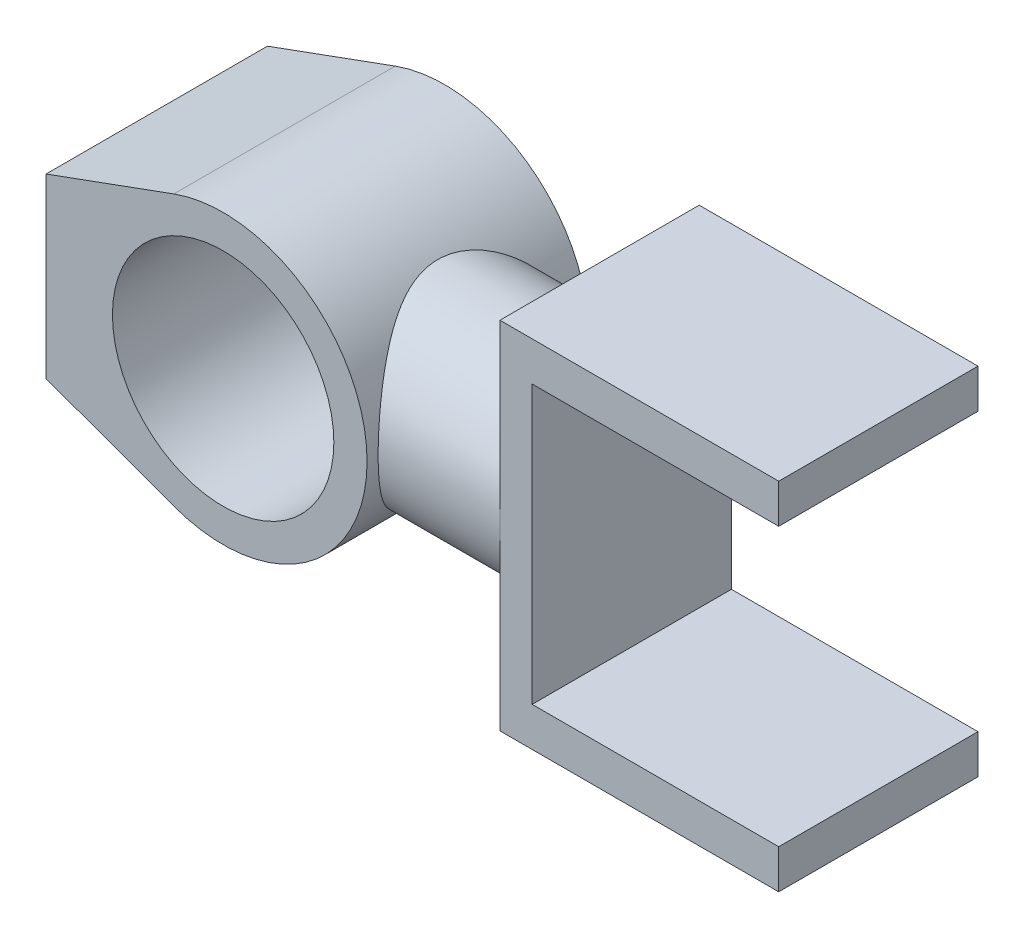
ISO-10303-21;
HEADER;
FILE_DESCRIPTION(('STEP AP214'),'2;1');
FILE_NAME('part.step','',(''),(''),'','','');
FILE_SCHEMA(('AUTOMOTIVE_DESIGN { 1 0 10303 214 1 1 1 1 }'));
ENDSEC;
DATA;
#1=APPLICATION_CONTEXT('core data for automotive mechanical design processes');
#2=APPLICATION_PROTOCOL_DEFINITION('international standard','automotive_design',2000,#1);
#3=PRODUCT_CONTEXT('',#1,'mechanical');
#4=PRODUCT('Part','Part','',(#3));
#5=PRODUCT_RELATED_PRODUCT_CATEGORY('part','',(#4));
#6=PRODUCT_DEFINITION_FORMATION('','',#4);
#7=PRODUCT_DEFINITION_CONTEXT('part definition',#1,'design');
#8=PRODUCT_DEFINITION('design','',#6,#7);
#9=PRODUCT_DEFINITION_SHAPE('','',#8);
#10=(LENGTH_UNIT() NAMED_UNIT(*) SI_UNIT(.MILLI.,.METRE.));
#11=(NAMED_UNIT(*) PLANE_ANGLE_UNIT() SI_UNIT($,.RADIAN.));
#12=(NAMED_UNIT(*) SI_UNIT($,.STERADIAN.) SOLID_ANGLE_UNIT());
#13=UNCERTAINTY_MEASURE_WITH_UNIT(LENGTH_MEASURE(1.E-05),#10,'distance_accuracy_value','');
#14=(GEOMETRIC_REPRESENTATION_CONTEXT(3) GLOBAL_UNCERTAINTY_ASSIGNED_CONTEXT((#13)) GLOBAL_UNIT_ASSIGNED_CONTEXT((#10,
#11,#12)) REPRESENTATION_CONTEXT('',''));
#15=CARTESIAN_POINT('',(0.,0.,0.));
#16=DIRECTION('',(0.,0.,1.));
#17=DIRECTION('',(1.,0.,0.));
#18=AXIS2_PLACEMENT_3D('',#15,#16,#17);
#19=CARTESIAN_POINT('',(0.,0.,50.));
#20=DIRECTION('',(0.,0.,1.));
#21=DIRECTION('',(1.,0.,0.));
#22=AXIS2_PLACEMENT_3D('',#19,#20,#21);
#23=PLANE('',#22);
#24=DIRECTION('',(0.939410286372225,-0.342794856813887,0.));
#25=VECTOR('',#24,1.);
#26=CARTESIAN_POINT('',(-80.,-40.,50.));
#27=LINE('',#26,#25);
#28=CARTESIAN_POINT('',(-80.,-40.,50.));
#29=VERTEX_POINT('',#28);
#30=CARTESIAN_POINT('',(-22.2816656929027,-61.0616686141946,50.));
#31=VERTEX_POINT('',#30);
#32=EDGE_CURVE('E309',#29,#31,#27,.T.);
#33=ORIENTED_EDGE('',*,*,#32,.T.);
#34=CARTESIAN_POINT('',(0.,0.,50.));
#35=DIRECTION('',(0.,0.,1.));
#36=DIRECTION('',(1.,0.,0.));
#37=AXIS2_PLACEMENT_3D('',#34,#35,#36);
#38=CIRCLE('',#37,65.);
#39=CARTESIAN_POINT('',(-22.2816656929027,61.0616686141947,50.));
#40=VERTEX_POINT('',#39);
#41=EDGE_CURVE('E90',#31,#40,#38,.T.);
#42=ORIENTED_EDGE('',*,*,#41,.T.);
#43=DIRECTION('',(-0.939410286372225,-0.342794856813887,0.));
#44=VECTOR('',#43,1.);
#45=CARTESIAN_POINT('',(-80.,40.,50.));
#46=LINE('',#45,#44);
#47=CARTESIAN_POINT('',(-80.,40.,50.));
#48=VERTEX_POINT('',#47);
#49=EDGE_CURVE('E305',#40,#48,#46,.T.);
#50=ORIENTED_EDGE('',*,*,#49,.T.);
#51=DIRECTION('',(0.,-1.,0.));
#52=VECTOR('',#51,1.);
#53=CARTESIAN_POINT('',(-80.,40.,50.));
#54=LINE('',#53,#52);
#55=EDGE_CURVE('E62',#48,#29,#54,.T.);
#56=ORIENTED_EDGE('',*,*,#55,.T.);
#57=EDGE_LOOP('',(#33,#42,#50,#56));
#58=FACE_BOUND('',#57,.T.);
#59=CARTESIAN_POINT('',(0.,0.,50.));
#60=DIRECTION('',(0.,0.,1.));
#61=DIRECTION('',(1.,0.,0.));
#62=AXIS2_PLACEMENT_3D('',#59,#60,#61);
#63=CIRCLE('',#62,50.);
#64=CARTESIAN_POINT('',(50.,0.,50.));
#65=VERTEX_POINT('',#64);
#66=EDGE_CURVE('E319',#65,#65,#63,.T.);
#67=ORIENTED_EDGE('',*,*,#66,.F.);
#68=EDGE_LOOP('',(#67));
#69=FACE_BOUND('',#68,.T.);
#70=ADVANCED_FACE('F39',(#58,#69),#23,.T.);
#71=CARTESIAN_POINT('',(0.,0.,-50.));
#72=DIRECTION('',(0.,0.,1.));
#73=DIRECTION('',(1.,0.,0.));
#74=AXIS2_PLACEMENT_3D('',#71,#72,#73);
#75=PLANE('',#74);
#76=DIRECTION('',(0.939410286372225,-0.342794856813887,0.));
#77=VECTOR('',#76,1.);
#78=CARTESIAN_POINT('',(-80.,-40.,-50.));
#79=LINE('',#78,#77);
#80=CARTESIAN_POINT('',(-80.,-40.,-50.));
#81=VERTEX_POINT('',#80);
#82=CARTESIAN_POINT('',(-22.2816656929027,-61.0616686141946,-50.));
#83=VERTEX_POINT('',#82);
#84=EDGE_CURVE('E302',#81,#83,#79,.T.);
#85=ORIENTED_EDGE('',*,*,#84,.F.);
#86=DIRECTION('',(0.,-1.,0.));
#87=VECTOR('',#86,1.);
#88=CARTESIAN_POINT('',(-80.,40.,-50.));
#89=LINE('',#88,#87);
#90=CARTESIAN_POINT('',(-80.,40.,-50.));
#91=VERTEX_POINT('',#90);
#92=EDGE_CURVE('E83',#91,#81,#89,.T.);
#93=ORIENTED_EDGE('',*,*,#92,.F.);
#94=DIRECTION('',(-0.939410286372225,-0.342794856813887,0.));
#95=VECTOR('',#94,1.);
#96=CARTESIAN_POINT('',(-80.,40.,-50.));
#97=LINE('',#96,#95);
#98=CARTESIAN_POINT('',(-22.2816656929027,61.0616686141947,-50.));
#99=VERTEX_POINT('',#98);
#100=EDGE_CURVE('E301',#99,#91,#97,.T.);
#101=ORIENTED_EDGE('',*,*,#100,.F.);
#102=CARTESIAN_POINT('',(0.,0.,-50.));
#103=DIRECTION('',(0.,0.,1.));
#104=DIRECTION('',(1.,0.,0.));
#105=AXIS2_PLACEMENT_3D('',#102,#103,#104);
#106=CIRCLE('',#105,65.);
#107=EDGE_CURVE('E294',#83,#99,#106,.T.);
#108=ORIENTED_EDGE('',*,*,#107,.F.);
#109=EDGE_LOOP('',(#85,#93,#101,#108));
#110=FACE_BOUND('',#109,.T.);
#111=CARTESIAN_POINT('',(0.,0.,-50.));
#112=DIRECTION('',(0.,0.,1.));
#113=DIRECTION('',(1.,0.,0.));
#114=AXIS2_PLACEMENT_3D('',#111,#112,#113);
#115=CIRCLE('',#114,50.);
#116=CARTESIAN_POINT('',(50.,0.,-50.));
#117=VERTEX_POINT('',#116);
#118=EDGE_CURVE('E321',#117,#117,#115,.T.);
#119=ORIENTED_EDGE('',*,*,#118,.T.);
#120=EDGE_LOOP('',(#119));
#121=FACE_BOUND('',#120,.T.);
#122=ADVANCED_FACE('F270',(#110,#121),#75,.F.);
#123=CARTESIAN_POINT('',(-80.,-40.,50.));
#124=DIRECTION('',(0.342794856813887,0.939410286372225,0.));
#125=DIRECTION('',(-0.939410286372225,0.342794856813887,0.));
#126=AXIS2_PLACEMENT_3D('',#123,#124,#125);
#127=PLANE('',#126);
#128=ORIENTED_EDGE('',*,*,#84,.T.);
#129=DIRECTION('',(0.,0.,-1.));
#130=VECTOR('',#129,1.);
#131=CARTESIAN_POINT('',(-22.2816656929027,-61.0616686141946,50.));
#132=LINE('',#131,#130);
#133=EDGE_CURVE('E11',#31,#83,#132,.T.);
#134=ORIENTED_EDGE('',*,*,#133,.F.);
#135=ORIENTED_EDGE('',*,*,#32,.F.);
#136=DIRECTION('',(0.,0.,-1.));
#137=VECTOR('',#136,1.);
#138=CARTESIAN_POINT('',(-80.,-40.,50.));
#139=LINE('',#138,#137);
#140=EDGE_CURVE('E313',#29,#81,#139,.T.);
#141=ORIENTED_EDGE('',*,*,#140,.T.);
#142=EDGE_LOOP('',(#128,#134,#135,#141));
#143=FACE_BOUND('',#142,.T.);
#144=ADVANCED_FACE('F41',(#143),#127,.F.);
#145=CARTESIAN_POINT('',(0.,0.,50.));
#146=DIRECTION('',(0.,0.,-1.));
#147=DIRECTION('',(-1.,0.,0.));
#148=AXIS2_PLACEMENT_3D('',#145,#146,#147);
#149=CYLINDRICAL_SURFACE('',#148,65.);
#150=CARTESIAN_POINT('',(65.,0.,-45.));
#151=CARTESIAN_POINT('',(65.0000011696057,1.12147330120565,-45.0000012025283));
#152=CARTESIAN_POINT('',(64.9709159765212,2.24292945230778,-44.9580201602482));
#153=CARTESIAN_POINT('',(64.8553068641383,4.47658414079082,-44.790785609369));
#154=CARTESIAN_POINT('',(64.7687842573088,5.58878288911931,-44.6655340035371));
#155=CARTESIAN_POINT('',(64.5403785763001,7.79555151848628,-44.3336771879691));
#156=CARTESIAN_POINT('',(64.3984760503456,8.89011506447751,-44.1270433931238));
#157=CARTESIAN_POINT('',(64.0626457436966,11.0533096019768,-43.6354760134034));
#158=CARTESIAN_POINT('',(63.8687169569864,12.1219400915896,-43.3505409144375));
#159=CARTESIAN_POINT('',(63.4342222744662,14.2212125160505,-42.7078017297046));
#160=CARTESIAN_POINT('',(63.1938918545645,15.2520162370063,-42.3503651251477));
#161=CARTESIAN_POINT('',(62.6709259446924,17.2756280115286,-41.5659763086892));
#162=CARTESIAN_POINT('',(62.3882907364915,18.268436318107,-41.1390245597888));
#163=CARTESIAN_POINT('',(61.786108553932,20.2116697228795,-40.2199419970838));
#164=CARTESIAN_POINT('',(61.4665619062631,21.1620951960855,-39.7278117601444));
#165=CARTESIAN_POINT('',(60.7962171584065,23.0172309124314,-38.6825647509799));
#166=CARTESIAN_POINT('',(60.4454175300334,23.9219389167185,-38.1294449962195));
#167=CARTESIAN_POINT('',(59.6865648974474,25.7601880140228,-36.9151737617935));
#168=CARTESIAN_POINT('',(59.27618815402,26.6893215363404,-36.2488040005491));
#169=CARTESIAN_POINT('',(58.4330275057249,28.4880338622967,-34.8529502059224));
#170=CARTESIAN_POINT('',(58.0002425478181,29.3576098626539,-34.1234632053608));
#171=CARTESIAN_POINT('',(57.1195111836477,31.0364486388513,-32.6040251352403));
#172=CARTESIAN_POINT('',(56.6715447181891,31.8456267033451,-31.8139921794123));
#173=CARTESIAN_POINT('',(55.7691986061138,33.4006700551814,-30.1773036556993));
#174=CARTESIAN_POINT('',(55.3148185876119,34.1465316534289,-29.3306447936721));
#175=CARTESIAN_POINT('',(54.3303114345595,35.6959084068904,-27.4326466159468));
#176=CARTESIAN_POINT('',(53.8005937511269,36.4872853280241,-26.3711450656527));
#177=CARTESIAN_POINT('',(52.7593327891933,37.9773509509911,-24.17604025639));
#178=CARTESIAN_POINT('',(52.2477941160227,38.6760162868262,-23.0424189272517));
#179=CARTESIAN_POINT('',(51.2608149265043,39.9749077721744,-20.7072341856928));
#180=CARTESIAN_POINT('',(50.7853275075273,40.5752630453964,-19.5057627267967));
#181=CARTESIAN_POINT('',(49.8892399163793,41.6721166930025,-17.036931864064));
#182=CARTESIAN_POINT('',(49.4686114171658,42.1686687478853,-15.7696069409943));
#183=CARTESIAN_POINT('',(48.8208029416879,42.9149535309565,-13.5723996352816));
#184=CARTESIAN_POINT('',(48.5738420263557,43.1936925213245,-12.6581208440976));
#185=CARTESIAN_POINT('',(48.1238801744123,43.6944569649788,-10.8035389223551));
#186=CARTESIAN_POINT('',(47.9208721021929,43.9164916250901,-9.86324004407419));
#187=CARTESIAN_POINT('',(47.5660754926548,44.3005296261305,-7.96250438663409));
#188=CARTESIAN_POINT('',(47.4142038087044,44.4626304606427,-7.00210302149487));
#189=CARTESIAN_POINT('',(47.1671263845177,44.7246555122386,-5.06554052628518));
#190=CARTESIAN_POINT('',(47.0719206259529,44.824579749433,-4.08937940131224));
#191=CARTESIAN_POINT('',(46.9418899090943,44.9607388198673,-2.1232364847967));
#192=CARTESIAN_POINT('',(46.9073939345417,44.9966266570423,-1.13320851844658));
#193=CARTESIAN_POINT('',(46.9013571135476,45.0029190462422,0.847248377093852));
#194=CARTESIAN_POINT('',(46.9298161498631,44.9733237202183,1.837677305534));
#195=CARTESIAN_POINT('',(47.0484302849821,44.8492190899201,3.81128752429081));
#196=CARTESIAN_POINT('',(47.13862305521,44.7546701492421,4.79446401850661));
#197=CARTESIAN_POINT('',(47.3768313176079,44.5024241630868,6.74551496467455));
#198=CARTESIAN_POINT('',(47.5248480621437,44.3447257499009,7.71338908473168));
#199=CARTESIAN_POINT('',(47.8621764271841,43.9803320764262,9.56919366964684));
#200=CARTESIAN_POINT('',(48.0484149088864,43.7772163066585,10.4583970625519));
#201=CARTESIAN_POINT('',(48.4609441046406,43.32010640119,12.2144143492181));
#202=CARTESIAN_POINT('',(48.6872496045115,43.0660934784815,13.0812198417583));
#203=CARTESIAN_POINT('',(49.1738509640383,42.5096331932465,14.7898225666927));
#204=CARTESIAN_POINT('',(49.4341648638834,42.2071601049958,15.6316062329481));
#205=CARTESIAN_POINT('',(49.9825182796335,41.5563350032134,17.2876417419013));
#206=CARTESIAN_POINT('',(50.2705534011697,41.2079902580444,18.1018979206949));
#207=CARTESIAN_POINT('',(51.0225431471345,40.2767822129268,20.1137766396802));
#208=CARTESIAN_POINT('',(51.5007434523328,39.6654891440572,21.2930273345177));
#209=CARTESIAN_POINT('',(52.4891158781477,38.348029920852,23.5833678403921));
#210=CARTESIAN_POINT('',(52.9993005340589,37.6418264436726,24.6944305853524));
#211=CARTESIAN_POINT('',(54.0361557973494,36.1376496350166,26.8476775780095));
#212=CARTESIAN_POINT('',(54.5628535785461,35.3395185623559,27.8897384505711));
#213=CARTESIAN_POINT('',(55.6171804467178,33.6558443419671,29.8998791095632));
#214=CARTESIAN_POINT('',(56.1448094104418,32.7703120184234,30.8679680307498));
#215=CARTESIAN_POINT('',(57.1932449701135,30.9045304086319,32.7363921475659));
#216=CARTESIAN_POINT('',(57.7139191350983,29.9233731295192,33.6358963165067));
#217=CARTESIAN_POINT('',(58.7296419536465,27.8771206485979,35.350355349792));
#218=CARTESIAN_POINT('',(59.2246882700661,26.8120178135979,36.1653025097018));
#219=CARTESIAN_POINT('',(60.1756566955639,24.6035209522421,37.7024332048813));
#220=CARTESIAN_POINT('',(60.6316475651595,23.4602711709794,38.4247809320632));
#221=CARTESIAN_POINT('',(61.4931891608211,21.0989507187335,39.7703323765769));
#222=CARTESIAN_POINT('',(61.898755017873,19.8809026570889,40.3935658507715));
#223=CARTESIAN_POINT('',(62.5646802947783,17.6549035875762,41.4059204565395));
#224=CARTESIAN_POINT('',(62.8372982548467,16.6602403417733,41.8163120535009));
#225=CARTESIAN_POINT('',(63.3397164077328,14.6345031625144,42.5675669112335));
#226=CARTESIAN_POINT('',(63.569522535998,13.603434299959,42.9084398107234));
#227=CARTESIAN_POINT('',(63.9815049902596,11.5110112910016,43.5164676119118));
#228=CARTESIAN_POINT('',(64.1637052650743,10.4496726714621,43.7836595836378));
#229=CARTESIAN_POINT('',(64.476639865795,8.30296993183371,44.2409869387356));
#230=CARTESIAN_POINT('',(64.6073730982257,7.21760530180254,44.431120684921));
#231=CARTESIAN_POINT('',(64.8147345736682,5.02649787175023,44.7321113931983));
#232=CARTESIAN_POINT('',(64.8911534961694,3.92069290489763,44.8426616714377));
#233=CARTESIAN_POINT('',(64.9872183357685,1.70145350776208,44.981563734156));
#234=CARTESIAN_POINT('',(65.0068642771874,0.588019080747696,45.0099155538474));
#235=CARTESIAN_POINT('',(64.9889001241945,-1.63741781931566,44.9839662509349));
#236=CARTESIAN_POINT('',(64.9512898349751,-2.74942028747967,44.929664847113));
#237=CARTESIAN_POINT('',(64.819734418053,-4.96298947367603,44.7392747901952));
#238=CARTESIAN_POINT('',(64.7257910494465,-6.06455651648127,44.6031886909653));
#239=CARTESIAN_POINT('',(64.491175703309,-8.18254449212149,44.2620157992034));
#240=CARTESIAN_POINT('',(64.3536808680178,-9.20007959997774,44.0616107864454));
#241=CARTESIAN_POINT('',(64.0337856060908,-11.2121337136589,43.5930613516679));
#242=CARTESIAN_POINT('',(63.8513873855499,-12.2066538475799,43.3249202574929));
#243=CARTESIAN_POINT('',(63.4451725249075,-14.1673074608523,42.7239854011605));
#244=CARTESIAN_POINT('',(63.2213525684632,-15.1334386601223,42.3911864622047));
#245=CARTESIAN_POINT('',(62.736336352677,-17.0327019487273,41.6643868113868));
#246=CARTESIAN_POINT('',(62.4751380044848,-17.965832190203,41.2703826790343));
#247=CARTESIAN_POINT('',(61.8990085085122,-19.8637431772395,40.3931275129008));
#248=CARTESIAN_POINT('',(61.5815209528501,-20.8256806929253,39.9054081529014));
#249=CARTESIAN_POINT('',(60.9142086391395,-22.7035764997345,38.8677076181211));
#250=CARTESIAN_POINT('',(60.5643826081083,-23.6195329786528,38.3177239921568));
#251=CARTESIAN_POINT('',(59.8381347129401,-25.4032558353403,37.1592008079418));
#252=CARTESIAN_POINT('',(59.4616987975441,-26.270996314329,36.5506302507532));
#253=CARTESIAN_POINT('',(58.6884577670336,-27.9557544991496,35.2787474176625));
#254=CARTESIAN_POINT('',(58.2916515549571,-28.7727694681138,34.6154321925309));
#255=CARTESIAN_POINT('',(57.4151711853793,-30.4889708749912,33.1199200847161));
#256=CARTESIAN_POINT('',(56.9328754552547,-31.3785212006928,32.2781812569548));
#257=CARTESIAN_POINT('',(55.9590893109094,-33.0839042215169,30.5278352445589));
#258=CARTESIAN_POINT('',(55.4675975421249,-33.8997259516808,29.6192181500899));
#259=CARTESIAN_POINT('',(54.4860350387397,-35.45586994741,27.7375714933993));
#260=CARTESIAN_POINT('',(53.9959654596117,-36.1961418986443,26.7644997080007));
#261=CARTESIAN_POINT('',(53.0294834997435,-37.5978502361011,24.7568233036382));
#262=CARTESIAN_POINT('',(52.553069328415,-38.2592969946585,23.7222268074148));
#263=CARTESIAN_POINT('',(51.679941347726,-39.4291013564639,21.7149007388747));
#264=CARTESIAN_POINT('',(51.2803372484816,-39.9463152685162,20.7485884228094));
#265=CARTESIAN_POINT('',(50.5123974548912,-40.9130636661729,18.7705314851885));
#266=CARTESIAN_POINT('',(50.1440619804653,-41.3625976757848,17.7587865441704));
#267=CARTESIAN_POINT('',(49.4504928922364,-42.1893301292689,15.693797265063));
#268=CARTESIAN_POINT('',(49.1251906412473,-42.566644202947,14.6406225749502));
#269=CARTESIAN_POINT('',(48.5290098021012,-43.2451098617227,12.4950157035289));
#270=CARTESIAN_POINT('',(48.2581179989952,-43.5462799449171,11.4025931307277));
#271=CARTESIAN_POINT('',(47.8271610412375,-44.0186874861181,9.3921629994351));
#272=CARTESIAN_POINT('',(47.6558419905218,-44.2036946073207,8.47979353570419));
#273=CARTESIAN_POINT('',(47.3627606953031,-44.517583244497,6.63757582668245));
#274=CARTESIAN_POINT('',(47.2409923142224,-44.6464717105955,5.70772976070373));
#275=CARTESIAN_POINT('',(47.05166615705,-44.8459556683364,3.83718735816971));
#276=CARTESIAN_POINT('',(46.9840561376509,-44.9166073394187,2.89650236820514));
#277=CARTESIAN_POINT('',(46.9055698265682,-44.9985645522097,1.01014116515035));
#278=CARTESIAN_POINT('',(46.894694331428,-45.0098692606967,0.0644648821697862));
#279=CARTESIAN_POINT('',(46.9301408777119,-44.972908524549,-1.82506201386804));
#280=CARTESIAN_POINT('',(46.9764888551696,-44.9246160680299,-2.76891160474201));
#281=CARTESIAN_POINT('',(47.1245232303033,-44.7693052695385,-4.64731891289862));
#282=CARTESIAN_POINT('',(47.226209296244,-44.6622872796082,-5.58187668584874));
#283=CARTESIAN_POINT('',(47.4811423262629,-44.3911660407895,-7.43666598606561));
#284=CARTESIAN_POINT('',(47.634452919394,-44.2269923369625,-8.35687836049678));
#285=CARTESIAN_POINT('',(47.9871889035597,-43.8440109221367,-10.1768310643423));
#286=CARTESIAN_POINT('',(48.1866204648689,-43.6251959006593,-11.0765686368372));
#287=CARTESIAN_POINT('',(48.6908782922366,-43.0625185245671,-13.116726178063));
#288=CARTESIAN_POINT('',(49.0093972350599,-42.7008255731353,-14.2488681052183));
#289=CARTESIAN_POINT('',(49.699554494161,-41.8955268796886,-16.4668795226373));
#290=CARTESIAN_POINT('',(50.0712093704162,-41.4518955887103,-17.5527344499461));
#291=CARTESIAN_POINT('',(50.8544123719762,-40.4872212981013,-19.6760329984318));
#292=CARTESIAN_POINT('',(51.2660067549033,-39.9660881554129,-20.7134183727638));
#293=CARTESIAN_POINT('',(52.116211879306,-38.8508952329155,-22.7363587217865));
#294=CARTESIAN_POINT('',(52.5548209260535,-38.2568400254561,-23.7219169406072));
#295=CARTESIAN_POINT('',(53.4579357785502,-36.9847423381263,-25.6613286822633));
#296=CARTESIAN_POINT('',(53.9228021101371,-36.3051118639051,-26.6139712103077));
#297=CARTESIAN_POINT('',(54.8583333343946,-34.8753950985048,-28.4617532840731));
#298=CARTESIAN_POINT('',(55.3289982185488,-34.1253089107936,-29.3568929142368));
#299=CARTESIAN_POINT('',(56.2664339133503,-32.5564691651912,-31.0876310121466));
#300=CARTESIAN_POINT('',(56.7332035093429,-31.7376950080829,-31.923211478402));
#301=CARTESIAN_POINT('',(57.6535165855435,-30.033481652025,-33.5315189390535));
#302=CARTESIAN_POINT('',(58.1070588196762,-29.1480362003111,-34.3042400240121));
#303=CARTESIAN_POINT('',(59.0635284336244,-27.1643113596245,-35.9022819462667));
#304=CARTESIAN_POINT('',(59.5626106290919,-26.0547472869609,-36.7159606163356));
#305=CARTESIAN_POINT('',(60.5176757229357,-23.7521280348398,-38.2458641369291));
#306=CARTESIAN_POINT('',(60.9736519283074,-22.5590599397198,-38.962073861155));
#307=CARTESIAN_POINT('',(61.6149926579414,-20.7127348127311,-39.9558623322098));
#308=CARTESIAN_POINT('',(61.8215919655179,-20.088110583999,-40.2735888165198));
#309=CARTESIAN_POINT('',(62.2191547005856,-18.8206694867556,-40.8812436548858));
#310=CARTESIAN_POINT('',(62.4101203779565,-18.1778552539997,-41.1711760099034));
#311=CARTESIAN_POINT('',(62.7748527233683,-16.875283117665,-41.7219931318356));
#312=CARTESIAN_POINT('',(62.9486230408552,-16.2155288469421,-41.9828840638124));
#313=CARTESIAN_POINT('',(63.2775356475737,-14.8804011558233,-42.4744610119283));
#314=CARTESIAN_POINT('',(63.432679284421,-14.2050288695917,-42.7051492133046));
#315=CARTESIAN_POINT('',(63.8070721968101,-12.4447010544915,-43.25974494481));
#316=CARTESIAN_POINT('',(64.0114184468014,-11.3490405228654,-43.5602757498286));
#317=CARTESIAN_POINT('',(64.3654191982087,-9.12991345978806,-44.078827644396));
#318=CARTESIAN_POINT('',(64.5150820049425,-8.00645117856259,-44.2968612637911));
#319=CARTESIAN_POINT('',(64.7559993187061,-5.74082253729113,-44.6470112993716));
#320=CARTESIAN_POINT('',(64.847297757104,-4.59867091062173,-44.7791923387443));
#321=CARTESIAN_POINT('',(64.9692976296881,-2.30434018473195,-44.9556862638234));
#322=CARTESIAN_POINT('',(64.9999987983895,-1.15216104160189,-44.999998764566));
#323=CARTESIAN_POINT('',(65.,0.,-45.));
#324=B_SPLINE_CURVE_WITH_KNOTS('',3,(#150,#151,#152,#153,#154,#155,#156,#157,#158,#159,#160,
#161,#162,#163,#164,#165,#166,#167,#168,#169,#170,#171,#172,#173,#174,#175,#176,#177,#178,#179,
#180,#181,#182,#183,#184,#185,#186,#187,#188,#189,#190,#191,#192,#193,#194,#195,#196,#197,#198,
#199,#200,#201,#202,#203,#204,#205,#206,#207,#208,#209,#210,#211,#212,#213,#214,#215,#216,#217,
#218,#219,#220,#221,#222,#223,#224,#225,#226,#227,#228,#229,#230,#231,#232,#233,#234,#235,#236,
#237,#238,#239,#240,#241,#242,#243,#244,#245,#246,#247,#248,#249,#250,#251,#252,#253,#254,#255,
#256,#257,#258,#259,#260,#261,#262,#263,#264,#265,#266,#267,#268,#269,#270,#271,#272,#273,#274,
#275,#276,#277,#278,#279,#280,#281,#282,#283,#284,#285,#286,#287,#288,#289,#290,#291,#292,#293,
#294,#295,#296,#297,#298,#299,#300,#301,#302,#303,#304,#305,#306,#307,#308,#309,#310,#311,#312,
#313,#314,#315,#316,#317,#318,#319,#320,#321,#322,#323),.UNSPECIFIED.,.T.,.F.,(4,2,2,2,2,2,2,2,
2,2,2,2,2,2,2,2,2,2,2,2,2,2,2,2,2,2,2,2,2,2,2,2,2,2,2,2,2,2,2,2,2,2,2,2,2,2,2,2,2,2,2,2,2,2,2,2,
2,2,2,2,2,2,2,2,2,2,2,2,2,2,2,2,2,2,2,2,2,2,2,2,2,2,2,2,2,2,4),(0.,3.36323892794144,
6.72640100710137,10.0907454360665,13.4551549250109,16.8029195613731,20.1506619010729,
23.4983746134034,26.8462511096753,30.4871649037346,34.1282499524345,37.7743494260164,
41.4206611917409,45.6939383064405,49.9682903731881,54.2369825353392,58.5034617073671,
61.4625138492405,64.4210852373372,67.3748225577202,70.3285589227263,73.2982527376573,
76.2679410220407,79.2394430998938,82.2110095388412,85.0011411726389,87.7923045951578,
90.584954683776,93.3771628083065,97.6064034875675,101.837312178738,106.075592113262,
110.313347816192,114.596218662803,118.879479402292,123.155037051935,127.429308626693,
130.755998382163,134.082226580387,137.406778235214,140.731400520075,144.068767009318,
147.406132068879,150.743508483461,154.080780688207,157.215791533369,160.350648386749,
163.485756334407,166.621039552604,169.990545063149,173.360183268584,176.73161428665,
180.103227050672,184.047902440152,187.993163521895,191.94103513809,195.888386692538,
199.385185586645,202.88200907258,206.373186157811,209.863514294626,212.700365177753,
215.536864625513,218.370624567028,221.204424293963,224.039508887241,226.874576485218,
229.713151272815,232.55210603787,236.23803941247,239.925124033801,243.616531168718,
247.307706963636,251.081871120678,254.856029735252,258.631324277359,262.406973327354,
266.792058434818,271.177823293658,273.368885604935,275.55963203795,277.749912517597,
279.940034437727,283.398420446896,286.856280978073,290.31153567335,293.766805506531),.UNSPECIFIED.);
#325=CARTESIAN_POINT('',(65.,0.,-45.));
#326=VERTEX_POINT('',#325);
#327=EDGE_CURVE('E161',#326,#326,#324,.T.);
#328=ORIENTED_EDGE('',*,*,#327,.F.);
#329=EDGE_LOOP('',(#328));
#330=FACE_BOUND('',#329,.T.);
#331=ORIENTED_EDGE('',*,*,#107,.T.);
#332=DIRECTION('',(0.,0.,-1.));
#333=VECTOR('',#332,1.);
#334=CARTESIAN_POINT('',(-22.2816656929027,61.0616686141947,50.));
#335=LINE('',#334,#333);
#336=EDGE_CURVE('E47',#40,#99,#335,.T.);
#337=ORIENTED_EDGE('',*,*,#336,.F.);
#338=ORIENTED_EDGE('',*,*,#41,.F.);
#339=ORIENTED_EDGE('',*,*,#133,.T.);
#340=EDGE_LOOP('',(#331,#337,#338,#339));
#341=FACE_BOUND('',#340,.T.);
#342=ADVANCED_FACE('F285',(#330,#341),#149,.T.);
#343=CARTESIAN_POINT('',(-80.,40.,50.));
#344=DIRECTION('',(0.342794856813887,-0.939410286372225,0.));
#345=DIRECTION('',(0.939410286372225,0.342794856813887,0.));
#346=AXIS2_PLACEMENT_3D('',#343,#344,#345);
#347=PLANE('',#346);
#348=ORIENTED_EDGE('',*,*,#100,.T.);
#349=DIRECTION('',(0.,0.,-1.));
#350=VECTOR('',#349,1.);
#351=CARTESIAN_POINT('',(-80.,40.,50.));
#352=LINE('',#351,#350);
#353=EDGE_CURVE('E306',#48,#91,#352,.T.);
#354=ORIENTED_EDGE('',*,*,#353,.F.);
#355=ORIENTED_EDGE('',*,*,#49,.F.);
#356=ORIENTED_EDGE('',*,*,#336,.T.);
#357=EDGE_LOOP('',(#348,#354,#355,#356));
#358=FACE_BOUND('',#357,.T.);
#359=ADVANCED_FACE('F283',(#358),#347,.F.);
#360=CARTESIAN_POINT('',(-80.,40.,50.));
#361=DIRECTION('',(1.,0.,0.));
#362=DIRECTION('',(0.,0.,-1.));
#363=AXIS2_PLACEMENT_3D('',#360,#361,#362);
#364=PLANE('',#363);
#365=ORIENTED_EDGE('',*,*,#92,.T.);
#366=ORIENTED_EDGE('',*,*,#140,.F.);
#367=ORIENTED_EDGE('',*,*,#55,.F.);
#368=ORIENTED_EDGE('',*,*,#353,.T.);
#369=EDGE_LOOP('',(#365,#366,#367,#368));
#370=FACE_BOUND('',#369,.T.);
#371=ADVANCED_FACE('F280',(#370),#364,.F.);
#372=CARTESIAN_POINT('',(0.,0.,50.));
#373=DIRECTION('',(0.,0.,-1.));
#374=DIRECTION('',(-1.,0.,0.));
#375=AXIS2_PLACEMENT_3D('',#372,#373,#374);
#376=CYLINDRICAL_SURFACE('',#375,50.);
#377=ORIENTED_EDGE('',*,*,#66,.T.);
#378=EDGE_LOOP('',(#377));
#379=FACE_BOUND('',#378,.T.);
#380=ORIENTED_EDGE('',*,*,#118,.F.);
#381=EDGE_LOOP('',(#380));
#382=FACE_BOUND('',#381,.T.);
#383=ADVANCED_FACE('F278',(#379,#382),#376,.F.);
#384=CARTESIAN_POINT('',(-80.002,0.,0.));
#385=DIRECTION('',(1.,0.,0.));
#386=DIRECTION('',(0.,0.,-1.));
#387=AXIS2_PLACEMENT_3D('',#384,#385,#386);
#388=CYLINDRICAL_SURFACE('',#387,45.);
#389=CARTESIAN_POINT('',(120.,0.,0.));
#390=DIRECTION('',(1.,0.,0.));
#391=DIRECTION('',(0.,0.,-1.));
#392=AXIS2_PLACEMENT_3D('',#389,#390,#391);
#393=CIRCLE('',#392,45.);
#394=CARTESIAN_POINT('',(120.,0.,-45.));
#395=VERTEX_POINT('',#394);
#396=CARTESIAN_POINT('',(120.,0.,45.));
#397=VERTEX_POINT('',#396);
#398=EDGE_CURVE('E225',#395,#397,#393,.T.);
#399=ORIENTED_EDGE('',*,*,#398,.F.);
#400=EDGE_CURVE('E53',#397,#395,#393,.T.);
#401=ORIENTED_EDGE('',*,*,#400,.F.);
#402=EDGE_LOOP('',(#399,#401));
#403=FACE_BOUND('',#402,.T.);
#404=ORIENTED_EDGE('',*,*,#327,.T.);
#405=EDGE_LOOP('',(#404));
#406=FACE_BOUND('',#405,.T.);
#407=ADVANCED_FACE('F227',(#403,#406),#388,.T.);
#408=CARTESIAN_POINT('',(120.,45.,45.));
#409=DIRECTION('',(1.,0.,0.));
#410=DIRECTION('',(0.,0.,-1.));
#411=AXIS2_PLACEMENT_3D('',#408,#409,#410);
#412=PLANE('',#411);
#413=DIRECTION('',(0.,-1.,0.));
#414=VECTOR('',#413,1.);
#415=CARTESIAN_POINT('',(120.,45.,-45.));
#416=LINE('',#415,#414);
#417=CARTESIAN_POINT('',(120.,80.3066940989512,-45.));
#418=VERTEX_POINT('',#417);
#419=EDGE_CURVE('E153',#418,#395,#416,.T.);
#420=ORIENTED_EDGE('',*,*,#419,.T.);
#421=ORIENTED_EDGE('',*,*,#398,.T.);
#422=DIRECTION('',(0.,-1.,0.));
#423=VECTOR('',#422,1.);
#424=CARTESIAN_POINT('',(120.,45.,45.));
#425=LINE('',#424,#423);
#426=CARTESIAN_POINT('',(120.,80.3066940989512,45.));
#427=VERTEX_POINT('',#426);
#428=EDGE_CURVE('E188',#427,#397,#425,.T.);
#429=ORIENTED_EDGE('',*,*,#428,.F.);
#430=DIRECTION('',(0.,0.,-1.));
#431=VECTOR('',#430,1.);
#432=CARTESIAN_POINT('',(120.,80.3066940989512,45.));
#433=LINE('',#432,#431);
#434=EDGE_CURVE('E205',#427,#418,#433,.T.);
#435=ORIENTED_EDGE('',*,*,#434,.T.);
#436=EDGE_LOOP('',(#420,#421,#429,#435));
#437=FACE_BOUND('',#436,.T.);
#438=ADVANCED_FACE('F259',(#437),#412,.F.);
#439=CARTESIAN_POINT('',(120.,-80.3066940989512,45.));
#440=VERTEX_POINT('',#439);
#441=EDGE_CURVE('E187',#397,#440,#425,.T.);
#442=ORIENTED_EDGE('',*,*,#441,.F.);
#443=ORIENTED_EDGE('',*,*,#400,.T.);
#444=CARTESIAN_POINT('',(120.,-80.3066940989512,-45.));
#445=VERTEX_POINT('',#444);
#446=EDGE_CURVE('E143',#395,#445,#416,.T.);
#447=ORIENTED_EDGE('',*,*,#446,.T.);
#448=DIRECTION('',(0.,0.,-1.));
#449=VECTOR('',#448,1.);
#450=CARTESIAN_POINT('',(120.,-80.3066940989512,45.));
#451=LINE('',#450,#449);
#452=EDGE_CURVE('E147',#440,#445,#451,.T.);
#453=ORIENTED_EDGE('',*,*,#452,.F.);
#454=EDGE_LOOP('',(#442,#443,#447,#453));
#455=FACE_BOUND('',#454,.T.);
#456=ADVANCED_FACE('F146',(#455),#412,.F.);
#457=CARTESIAN_POINT('',(120.,-80.3066940989512,45.));
#458=DIRECTION('',(0.,1.,0.));
#459=DIRECTION('',(-1.,0.,0.));
#460=AXIS2_PLACEMENT_3D('',#457,#458,#459);
#461=PLANE('',#460);
#462=ORIENTED_EDGE('',*,*,#452,.T.);
#463=DIRECTION('',(1.,0.,0.));
#464=VECTOR('',#463,1.);
#465=CARTESIAN_POINT('',(120.,-80.3066940989512,-45.));
#466=LINE('',#465,#464);
#467=CARTESIAN_POINT('',(245.903834127145,-80.3066940989512,-45.));
#468=VERTEX_POINT('',#467);
#469=EDGE_CURVE('E159',#445,#468,#466,.T.);
#470=ORIENTED_EDGE('',*,*,#469,.T.);
#471=DIRECTION('',(0.,0.,-1.));
#472=VECTOR('',#471,1.);
#473=CARTESIAN_POINT('',(245.903834127145,-80.3066940989512,45.));
#474=LINE('',#473,#472);
#475=CARTESIAN_POINT('',(245.903834127145,-80.3066940989512,45.));
#476=VERTEX_POINT('',#475);
#477=EDGE_CURVE('E162',#476,#468,#474,.T.);
#478=ORIENTED_EDGE('',*,*,#477,.F.);
#479=DIRECTION('',(1.,0.,0.));
#480=VECTOR('',#479,1.);
#481=CARTESIAN_POINT('',(120.,-80.3066940989512,45.));
#482=LINE('',#481,#480);
#483=EDGE_CURVE('E160',#440,#476,#482,.T.);
#484=ORIENTED_EDGE('',*,*,#483,.F.);
#485=EDGE_LOOP('',(#462,#470,#478,#484));
#486=FACE_BOUND('',#485,.T.);
#487=ADVANCED_FACE('F157',(#486),#461,.F.);
#488=CARTESIAN_POINT('',(245.903834127145,-80.3066940989512,45.));
#489=DIRECTION('',(-1.,0.,0.));
#490=DIRECTION('',(0.,0.,1.));
#491=AXIS2_PLACEMENT_3D('',#488,#489,#490);
#492=PLANE('',#491);
#493=ORIENTED_EDGE('',*,*,#477,.T.);
#494=DIRECTION('',(0.,1.,0.));
#495=VECTOR('',#494,1.);
#496=CARTESIAN_POINT('',(245.903834127145,-80.3066940989512,-45.));
#497=LINE('',#496,#495);
#498=CARTESIAN_POINT('',(245.903834127145,-62.6533470494756,-45.));
#499=VERTEX_POINT('',#498);
#500=EDGE_CURVE('E168',#468,#499,#497,.T.);
#501=ORIENTED_EDGE('',*,*,#500,.T.);
#502=DIRECTION('',(0.,0.,-1.));
#503=VECTOR('',#502,1.);
#504=CARTESIAN_POINT('',(245.903834127145,-62.6533470494756,45.));
#505=LINE('',#504,#503);
#506=CARTESIAN_POINT('',(245.903834127145,-62.6533470494756,45.));
#507=VERTEX_POINT('',#506);
#508=EDGE_CURVE('E215',#507,#499,#505,.T.);
#509=ORIENTED_EDGE('',*,*,#508,.F.);
#510=DIRECTION('',(0.,1.,0.));
#511=VECTOR('',#510,1.);
#512=CARTESIAN_POINT('',(245.903834127145,-80.3066940989512,45.));
#513=LINE('',#512,#511);
#514=EDGE_CURVE('E192',#476,#507,#513,.T.);
#515=ORIENTED_EDGE('',*,*,#514,.F.);
#516=EDGE_LOOP('',(#493,#501,#509,#515));
#517=FACE_BOUND('',#516,.T.);
#518=ADVANCED_FACE('F234',(#517),#492,.F.);
#519=CARTESIAN_POINT('',(245.903834127145,-62.6533470494756,45.));
#520=DIRECTION('',(0.,-1.,0.));
#521=DIRECTION('',(1.,0.,0.));
#522=AXIS2_PLACEMENT_3D('',#519,#520,#521);
#523=PLANE('',#522);
#524=ORIENTED_EDGE('',*,*,#508,.T.);
#525=DIRECTION('',(-1.,0.,0.));
#526=VECTOR('',#525,1.);
#527=CARTESIAN_POINT('',(245.903834127145,-62.6533470494756,-45.));
#528=LINE('',#527,#526);
#529=CARTESIAN_POINT('',(134.550333896596,-62.6533470494756,-45.));
#530=VERTEX_POINT('',#529);
#531=EDGE_CURVE('E170',#499,#530,#528,.T.);
#532=ORIENTED_EDGE('',*,*,#531,.T.);
#533=DIRECTION('',(0.,0.,-1.));
#534=VECTOR('',#533,1.);
#535=CARTESIAN_POINT('',(134.550333896596,-62.6533470494756,45.));
#536=LINE('',#535,#534);
#537=CARTESIAN_POINT('',(134.550333896596,-62.6533470494756,45.));
#538=VERTEX_POINT('',#537);
#539=EDGE_CURVE('E213',#538,#530,#536,.T.);
#540=ORIENTED_EDGE('',*,*,#539,.F.);
#541=DIRECTION('',(-1.,0.,0.));
#542=VECTOR('',#541,1.);
#543=CARTESIAN_POINT('',(245.903834127145,-62.6533470494756,45.));
#544=LINE('',#543,#542);
#545=EDGE_CURVE('E194',#507,#538,#544,.T.);
#546=ORIENTED_EDGE('',*,*,#545,.F.);
#547=EDGE_LOOP('',(#524,#532,#540,#546));
#548=FACE_BOUND('',#547,.T.);
#549=ADVANCED_FACE('F237',(#548),#523,.F.);
#550=CARTESIAN_POINT('',(134.550333896596,62.6533470494756,45.));
#551=DIRECTION('',(-1.,0.,0.));
#552=DIRECTION('',(0.,0.,1.));
#553=AXIS2_PLACEMENT_3D('',#550,#551,#552);
#554=PLANE('',#553);
#555=ORIENTED_EDGE('',*,*,#539,.T.);
#556=DIRECTION('',(0.,1.,0.));
#557=VECTOR('',#556,1.);
#558=CARTESIAN_POINT('',(134.550333896596,62.6533470494756,-45.));
#559=LINE('',#558,#557);
#560=CARTESIAN_POINT('',(134.550333896596,62.6533470494756,-45.));
#561=VERTEX_POINT('',#560);
#562=EDGE_CURVE('E175',#530,#561,#559,.T.);
#563=ORIENTED_EDGE('',*,*,#562,.T.);
#564=DIRECTION('',(0.,0.,-1.));
#565=VECTOR('',#564,1.);
#566=CARTESIAN_POINT('',(134.550333896596,62.6533470494756,45.));
#567=LINE('',#566,#565);
#568=CARTESIAN_POINT('',(134.550333896596,62.6533470494756,45.));
#569=VERTEX_POINT('',#568);
#570=EDGE_CURVE('E211',#569,#561,#567,.T.);
#571=ORIENTED_EDGE('',*,*,#570,.F.);
#572=DIRECTION('',(0.,1.,0.));
#573=VECTOR('',#572,1.);
#574=CARTESIAN_POINT('',(134.550333896596,62.6533470494756,45.));
#575=LINE('',#574,#573);
#576=EDGE_CURVE('E196',#538,#569,#575,.T.);
#577=ORIENTED_EDGE('',*,*,#576,.F.);
#578=EDGE_LOOP('',(#555,#563,#571,#577));
#579=FACE_BOUND('',#578,.T.);
#580=ADVANCED_FACE('F241',(#579),#554,.F.);
#581=CARTESIAN_POINT('',(245.903834127145,62.6533470494756,45.));
#582=DIRECTION('',(0.,1.,0.));
#583=DIRECTION('',(0.,0.,1.));
#584=AXIS2_PLACEMENT_3D('',#581,#582,#583);
#585=PLANE('',#584);
#586=ORIENTED_EDGE('',*,*,#570,.T.);
#587=DIRECTION('',(1.,0.,0.));
#588=VECTOR('',#587,1.);
#589=CARTESIAN_POINT('',(245.903834127145,62.6533470494756,-45.));
#590=LINE('',#589,#588);
#591=CARTESIAN_POINT('',(245.903834127145,62.6533470494756,-45.));
#592=VERTEX_POINT('',#591);
#593=EDGE_CURVE('E178',#561,#592,#590,.T.);
#594=ORIENTED_EDGE('',*,*,#593,.T.);
#595=DIRECTION('',(0.,0.,-1.));
#596=VECTOR('',#595,1.);
#597=CARTESIAN_POINT('',(245.903834127145,62.6533470494756,45.));
#598=LINE('',#597,#596);
#599=CARTESIAN_POINT('',(245.903834127145,62.6533470494756,45.));
#600=VERTEX_POINT('',#599);
#601=EDGE_CURVE('E209',#600,#592,#598,.T.);
#602=ORIENTED_EDGE('',*,*,#601,.F.);
#603=DIRECTION('',(1.,0.,0.));
#604=VECTOR('',#603,1.);
#605=CARTESIAN_POINT('',(245.903834127145,62.6533470494756,45.));
#606=LINE('',#605,#604);
#607=EDGE_CURVE('E198',#569,#600,#606,.T.);
#608=ORIENTED_EDGE('',*,*,#607,.F.);
#609=EDGE_LOOP('',(#586,#594,#602,#608));
#610=FACE_BOUND('',#609,.T.);
#611=ADVANCED_FACE('F245',(#610),#585,.F.);
#612=CARTESIAN_POINT('',(245.903834127145,80.3066940989512,45.));
#613=DIRECTION('',(-1.,0.,0.));
#614=DIRECTION('',(0.,0.,1.));
#615=AXIS2_PLACEMENT_3D('',#612,#613,#614);
#616=PLANE('',#615);
#617=ORIENTED_EDGE('',*,*,#601,.T.);
#618=DIRECTION('',(0.,1.,0.));
#619=VECTOR('',#618,1.);
#620=CARTESIAN_POINT('',(245.903834127145,80.3066940989512,-45.));
#621=LINE('',#620,#619);
#622=CARTESIAN_POINT('',(245.903834127145,80.3066940989512,-45.));
#623=VERTEX_POINT('',#622);
#624=EDGE_CURVE('E181',#592,#623,#621,.T.);
#625=ORIENTED_EDGE('',*,*,#624,.T.);
#626=DIRECTION('',(0.,0.,-1.));
#627=VECTOR('',#626,1.);
#628=CARTESIAN_POINT('',(245.903834127145,80.3066940989512,45.));
#629=LINE('',#628,#627);
#630=CARTESIAN_POINT('',(245.903834127145,80.3066940989512,45.));
#631=VERTEX_POINT('',#630);
#632=EDGE_CURVE('E207',#631,#623,#629,.T.);
#633=ORIENTED_EDGE('',*,*,#632,.F.);
#634=DIRECTION('',(0.,1.,0.));
#635=VECTOR('',#634,1.);
#636=CARTESIAN_POINT('',(245.903834127145,80.3066940989512,45.));
#637=LINE('',#636,#635);
#638=EDGE_CURVE('E200',#600,#631,#637,.T.);
#639=ORIENTED_EDGE('',*,*,#638,.F.);
#640=EDGE_LOOP('',(#617,#625,#633,#639));
#641=FACE_BOUND('',#640,.T.);
#642=ADVANCED_FACE('F249',(#641),#616,.F.);
#643=CARTESIAN_POINT('',(120.,80.3066940989512,45.));
#644=DIRECTION('',(0.,-1.,0.));
#645=DIRECTION('',(0.,0.,-1.));
#646=AXIS2_PLACEMENT_3D('',#643,#644,#645);
#647=PLANE('',#646);
#648=ORIENTED_EDGE('',*,*,#632,.T.);
#649=DIRECTION('',(-1.,0.,0.));
#650=VECTOR('',#649,1.);
#651=CARTESIAN_POINT('',(120.,80.3066940989512,-45.));
#652=LINE('',#651,#650);
#653=EDGE_CURVE('E184',#623,#418,#652,.T.);
#654=ORIENTED_EDGE('',*,*,#653,.T.);
#655=ORIENTED_EDGE('',*,*,#434,.F.);
#656=DIRECTION('',(-1.,0.,0.));
#657=VECTOR('',#656,1.);
#658=CARTESIAN_POINT('',(120.,80.3066940989512,45.));
#659=LINE('',#658,#657);
#660=EDGE_CURVE('E202',#631,#427,#659,.T.);
#661=ORIENTED_EDGE('',*,*,#660,.F.);
#662=EDGE_LOOP('',(#648,#654,#655,#661));
#663=FACE_BOUND('',#662,.T.);
#664=ADVANCED_FACE('F253',(#663),#647,.F.);
#665=CARTESIAN_POINT('',(0.,0.,45.));
#666=DIRECTION('',(0.,0.,1.));
#667=DIRECTION('',(1.,0.,0.));
#668=AXIS2_PLACEMENT_3D('',#665,#666,#667);
#669=PLANE('',#668);
#670=ORIENTED_EDGE('',*,*,#428,.T.);
#671=ORIENTED_EDGE('',*,*,#441,.T.);
#672=ORIENTED_EDGE('',*,*,#483,.T.);
#673=ORIENTED_EDGE('',*,*,#514,.T.);
#674=ORIENTED_EDGE('',*,*,#545,.T.);
#675=ORIENTED_EDGE('',*,*,#576,.T.);
#676=ORIENTED_EDGE('',*,*,#607,.T.);
#677=ORIENTED_EDGE('',*,*,#638,.T.);
#678=ORIENTED_EDGE('',*,*,#660,.T.);
#679=EDGE_LOOP('',(#670,#671,#672,#673,#674,#675,#676,#677,#678));
#680=FACE_BOUND('',#679,.T.);
#681=ADVANCED_FACE('F257',(#680),#669,.T.);
#682=CARTESIAN_POINT('',(0.,0.,-45.));
#683=DIRECTION('',(0.,0.,1.));
#684=DIRECTION('',(1.,0.,0.));
#685=AXIS2_PLACEMENT_3D('',#682,#683,#684);
#686=PLANE('',#685);
#687=ORIENTED_EDGE('',*,*,#419,.F.);
#688=ORIENTED_EDGE('',*,*,#653,.F.);
#689=ORIENTED_EDGE('',*,*,#624,.F.);
#690=ORIENTED_EDGE('',*,*,#593,.F.);
#691=ORIENTED_EDGE('',*,*,#562,.F.);
#692=ORIENTED_EDGE('',*,*,#531,.F.);
#693=ORIENTED_EDGE('',*,*,#500,.F.);
#694=ORIENTED_EDGE('',*,*,#469,.F.);
#695=ORIENTED_EDGE('',*,*,#446,.F.);
#696=EDGE_LOOP('',(#687,#688,#689,#690,#691,#692,#693,#694,#695));
#697=FACE_BOUND('',#696,.T.);
#698=ADVANCED_FACE('F165',(#697),#686,.F.);
#699=CLOSED_SHELL('',(#70,#122,#144,#342,#359,#371,#383,#407,#438,#456,#487,#518,#549,#580,#611,
#642,#664,#681,#698));
#700=MANIFOLD_SOLID_BREP('B2',#699);
#701=ADVANCED_BREP_SHAPE_REPRESENTATION('',(#18,#700),#14);
#702=SHAPE_DEFINITION_REPRESENTATION(#9,#701);
ENDSEC;
END-ISO-10303-21;
